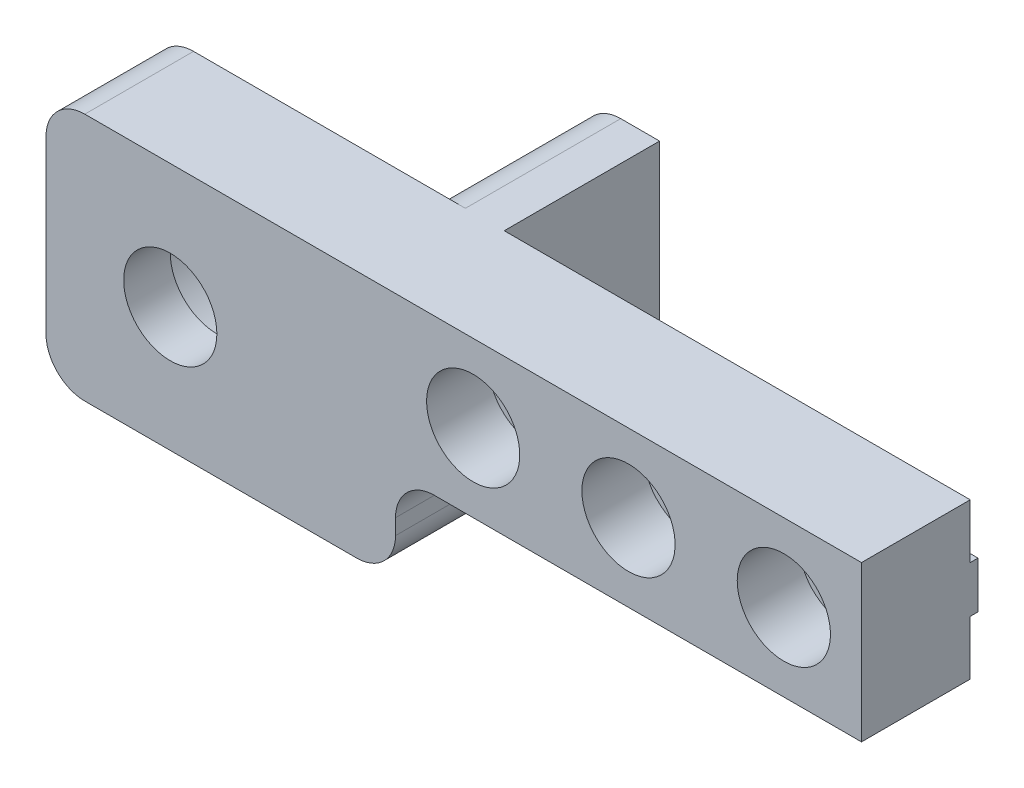
ISO-10303-21;
HEADER;
FILE_DESCRIPTION(('STEP AP214'),'2;1');
FILE_NAME('part.step','',(''),(''),'','','');
FILE_SCHEMA(('AUTOMOTIVE_DESIGN { 1 0 10303 214 1 1 1 1 }'));
ENDSEC;
DATA;
#1=APPLICATION_CONTEXT('core data for automotive mechanical design processes');
#2=APPLICATION_PROTOCOL_DEFINITION('international standard','automotive_design',2000,#1);
#3=PRODUCT_CONTEXT('',#1,'mechanical');
#4=PRODUCT('Part','Part','',(#3));
#5=PRODUCT_RELATED_PRODUCT_CATEGORY('part','',(#4));
#6=PRODUCT_DEFINITION_FORMATION('','',#4);
#7=PRODUCT_DEFINITION_CONTEXT('part definition',#1,'design');
#8=PRODUCT_DEFINITION('design','',#6,#7);
#9=PRODUCT_DEFINITION_SHAPE('','',#8);
#10=(LENGTH_UNIT() NAMED_UNIT(*) SI_UNIT(.MILLI.,.METRE.));
#11=(NAMED_UNIT(*) PLANE_ANGLE_UNIT() SI_UNIT($,.RADIAN.));
#12=(NAMED_UNIT(*) SI_UNIT($,.STERADIAN.) SOLID_ANGLE_UNIT());
#13=UNCERTAINTY_MEASURE_WITH_UNIT(LENGTH_MEASURE(1.E-05),#10,'distance_accuracy_value','');
#14=(GEOMETRIC_REPRESENTATION_CONTEXT(3) GLOBAL_UNCERTAINTY_ASSIGNED_CONTEXT((#13)) GLOBAL_UNIT_ASSIGNED_CONTEXT((#10,
#11,#12)) REPRESENTATION_CONTEXT('',''));
#15=CARTESIAN_POINT('',(0.,0.,0.));
#16=DIRECTION('',(0.,0.,1.));
#17=DIRECTION('',(1.,0.,0.));
#18=AXIS2_PLACEMENT_3D('',#15,#16,#17);
#19=CARTESIAN_POINT('',(-30.,-10.,-40.));
#20=DIRECTION('',(0.,0.,1.));
#21=DIRECTION('',(-1.,0.,0.));
#22=AXIS2_PLACEMENT_3D('',#19,#20,#21);
#23=CYLINDRICAL_SURFACE('',#22,2.75);
#24=CARTESIAN_POINT('',(-30.,-10.,-15.));
#25=DIRECTION('',(0.,0.,-1.));
#26=DIRECTION('',(-1.,0.,0.));
#27=AXIS2_PLACEMENT_3D('',#24,#25,#26);
#28=CIRCLE('',#27,2.75);
#29=CARTESIAN_POINT('',(-32.75,-10.,-15.));
#30=VERTEX_POINT('',#29);
#31=EDGE_CURVE('E327',#30,#30,#28,.T.);
#32=ORIENTED_EDGE('',*,*,#31,.T.);
#33=EDGE_LOOP('',(#32));
#34=FACE_BOUND('',#33,.T.);
#35=CARTESIAN_POINT('',(-30.,-10.,-8.));
#36=DIRECTION('',(0.,0.,-1.));
#37=DIRECTION('',(-1.,0.,0.));
#38=AXIS2_PLACEMENT_3D('',#35,#36,#37);
#39=CIRCLE('',#38,2.75);
#40=CARTESIAN_POINT('',(-32.75,-10.,-8.));
#41=VERTEX_POINT('',#40);
#42=EDGE_CURVE('E45',#41,#41,#39,.F.);
#43=ORIENTED_EDGE('',*,*,#42,.T.);
#44=EDGE_LOOP('',(#43));
#45=FACE_BOUND('',#44,.T.);
#46=ADVANCED_FACE('F41',(#34,#45),#23,.F.);
#47=CARTESIAN_POINT('',(-10.,-10.,-40.));
#48=DIRECTION('',(0.,0.,1.));
#49=DIRECTION('',(-1.,0.,0.));
#50=AXIS2_PLACEMENT_3D('',#47,#48,#49);
#51=CYLINDRICAL_SURFACE('',#50,2.75);
#52=CARTESIAN_POINT('',(-10.,-10.,-15.));
#53=DIRECTION('',(0.,0.,-1.));
#54=DIRECTION('',(-1.,0.,0.));
#55=AXIS2_PLACEMENT_3D('',#52,#53,#54);
#56=CIRCLE('',#55,2.75);
#57=CARTESIAN_POINT('',(-12.75,-10.,-15.));
#58=VERTEX_POINT('',#57);
#59=EDGE_CURVE('E330',#58,#58,#56,.T.);
#60=ORIENTED_EDGE('',*,*,#59,.T.);
#61=EDGE_LOOP('',(#60));
#62=FACE_BOUND('',#61,.T.);
#63=CARTESIAN_POINT('',(-10.,-10.,-8.));
#64=DIRECTION('',(0.,0.,-1.));
#65=DIRECTION('',(-1.,0.,0.));
#66=AXIS2_PLACEMENT_3D('',#63,#64,#65);
#67=CIRCLE('',#66,2.75);
#68=CARTESIAN_POINT('',(-12.75,-10.,-8.));
#69=VERTEX_POINT('',#68);
#70=EDGE_CURVE('E339',#69,#69,#67,.F.);
#71=ORIENTED_EDGE('',*,*,#70,.T.);
#72=EDGE_LOOP('',(#71));
#73=FACE_BOUND('',#72,.T.);
#74=ADVANCED_FACE('F366',(#62,#73),#51,.F.);
#75=CARTESIAN_POINT('',(-50.,-10.,-40.));
#76=DIRECTION('',(0.,0.,1.));
#77=DIRECTION('',(-1.,0.,0.));
#78=AXIS2_PLACEMENT_3D('',#75,#76,#77);
#79=CYLINDRICAL_SURFACE('',#78,2.75);
#80=CARTESIAN_POINT('',(-50.,-10.,-15.));
#81=DIRECTION('',(0.,0.,-1.));
#82=DIRECTION('',(-1.,0.,0.));
#83=AXIS2_PLACEMENT_3D('',#80,#81,#82);
#84=CIRCLE('',#83,2.75);
#85=CARTESIAN_POINT('',(-52.75,-10.,-15.));
#86=VERTEX_POINT('',#85);
#87=EDGE_CURVE('E333',#86,#86,#84,.T.);
#88=ORIENTED_EDGE('',*,*,#87,.T.);
#89=EDGE_LOOP('',(#88));
#90=FACE_BOUND('',#89,.T.);
#91=CARTESIAN_POINT('',(-50.,-10.,-8.));
#92=DIRECTION('',(0.,0.,-1.));
#93=DIRECTION('',(-1.,0.,0.));
#94=AXIS2_PLACEMENT_3D('',#91,#92,#93);
#95=CIRCLE('',#94,2.75);
#96=CARTESIAN_POINT('',(-52.75,-10.,-8.));
#97=VERTEX_POINT('',#96);
#98=EDGE_CURVE('E337',#97,#97,#95,.F.);
#99=ORIENTED_EDGE('',*,*,#98,.T.);
#100=EDGE_LOOP('',(#99));
#101=FACE_BOUND('',#100,.T.);
#102=ADVANCED_FACE('F372',(#90,#101),#79,.F.);
#103=CARTESIAN_POINT('',(0.,0.,-14.));
#104=DIRECTION('',(0.,0.,-1.));
#105=DIRECTION('',(1.,0.,0.));
#106=AXIS2_PLACEMENT_3D('',#103,#104,#105);
#107=PLANE('',#106);
#108=DIRECTION('',(1.,0.,0.));
#109=VECTOR('',#108,1.);
#110=CARTESIAN_POINT('',(-60.,-7.,-14.));
#111=LINE('',#110,#109);
#112=CARTESIAN_POINT('',(-60.,-7.,-14.));
#113=VERTEX_POINT('',#112);
#114=CARTESIAN_POINT('',(0.,-7.,-14.));
#115=VERTEX_POINT('',#114);
#116=EDGE_CURVE('E184',#113,#115,#111,.T.);
#117=ORIENTED_EDGE('',*,*,#116,.F.);
#118=DIRECTION('',(0.,1.,0.));
#119=VECTOR('',#118,1.);
#120=CARTESIAN_POINT('',(-60.,-32.,-14.));
#121=LINE('',#120,#119);
#122=CARTESIAN_POINT('',(-60.,0.,-14.));
#123=VERTEX_POINT('',#122);
#124=EDGE_CURVE('E211',#113,#123,#121,.T.);
#125=ORIENTED_EDGE('',*,*,#124,.T.);
#126=DIRECTION('',(-1.,0.,0.));
#127=VECTOR('',#126,1.);
#128=CARTESIAN_POINT('',(0.,0.,-14.));
#129=LINE('',#128,#127);
#130=CARTESIAN_POINT('',(0.,0.,-14.));
#131=VERTEX_POINT('',#130);
#132=EDGE_CURVE('E238',#131,#123,#129,.T.);
#133=ORIENTED_EDGE('',*,*,#132,.F.);
#134=DIRECTION('',(0.,1.,0.));
#135=VECTOR('',#134,1.);
#136=CARTESIAN_POINT('',(0.,-20.,-14.));
#137=LINE('',#136,#135);
#138=EDGE_CURVE('E237',#115,#131,#137,.T.);
#139=ORIENTED_EDGE('',*,*,#138,.F.);
#140=EDGE_LOOP('',(#117,#125,#133,#139));
#141=FACE_BOUND('',#140,.T.);
#142=ADVANCED_FACE('F421',(#141),#107,.T.);
#143=DIRECTION('',(0.,-1.,0.));
#144=VECTOR('',#143,1.);
#145=CARTESIAN_POINT('',(-105.,0.,-14.));
#146=LINE('',#145,#144);
#147=CARTESIAN_POINT('',(-105.,-5.00000000000001,-14.));
#148=VERTEX_POINT('',#147);
#149=CARTESIAN_POINT('',(-105.,-27.,-14.));
#150=VERTEX_POINT('',#149);
#151=EDGE_CURVE('E241',#148,#150,#146,.T.);
#152=ORIENTED_EDGE('',*,*,#151,.F.);
#153=CARTESIAN_POINT('',(-100.,-5.00000000000001,-14.));
#154=DIRECTION('',(0.,0.,1.));
#155=DIRECTION('',(1.,0.,0.));
#156=AXIS2_PLACEMENT_3D('',#153,#154,#155);
#157=CIRCLE('',#156,5.);
#158=CARTESIAN_POINT('',(-100.,0.,-14.));
#159=VERTEX_POINT('',#158);
#160=EDGE_CURVE('E303',#159,#148,#157,.T.);
#161=ORIENTED_EDGE('',*,*,#160,.F.);
#162=CARTESIAN_POINT('',(-65.,0.,-14.));
#163=VERTEX_POINT('',#162);
#164=EDGE_CURVE('E236',#163,#159,#129,.T.);
#165=ORIENTED_EDGE('',*,*,#164,.F.);
#166=CARTESIAN_POINT('',(-65.,-5.00000000000001,-14.));
#167=DIRECTION('',(0.,0.,1.));
#168=DIRECTION('',(1.,0.,0.));
#169=AXIS2_PLACEMENT_3D('',#166,#167,#168);
#170=CIRCLE('',#169,5.);
#171=CARTESIAN_POINT('',(-70.,-5.00000000000001,-14.));
#172=VERTEX_POINT('',#171);
#173=EDGE_CURVE('E11',#172,#163,#170,.F.);
#174=ORIENTED_EDGE('',*,*,#173,.F.);
#175=DIRECTION('',(0.,-1.,0.));
#176=VECTOR('',#175,1.);
#177=CARTESIAN_POINT('',(-70.,0.,-14.));
#178=LINE('',#177,#176);
#179=CARTESIAN_POINT('',(-70.,-27.,-14.));
#180=VERTEX_POINT('',#179);
#181=EDGE_CURVE('E200',#172,#180,#178,.T.);
#182=ORIENTED_EDGE('',*,*,#181,.T.);
#183=CARTESIAN_POINT('',(-65.,-27.,-14.));
#184=DIRECTION('',(0.,0.,1.));
#185=DIRECTION('',(1.,0.,0.));
#186=AXIS2_PLACEMENT_3D('',#183,#184,#185);
#187=CIRCLE('',#186,5.);
#188=CARTESIAN_POINT('',(-65.,-32.,-14.));
#189=VERTEX_POINT('',#188);
#190=EDGE_CURVE('E50',#189,#180,#187,.F.);
#191=ORIENTED_EDGE('',*,*,#190,.F.);
#192=DIRECTION('',(1.,0.,0.));
#193=VECTOR('',#192,1.);
#194=CARTESIAN_POINT('',(-105.,-32.,-14.));
#195=LINE('',#194,#193);
#196=CARTESIAN_POINT('',(-100.,-32.,-14.));
#197=VERTEX_POINT('',#196);
#198=EDGE_CURVE('E244',#197,#189,#195,.T.);
#199=ORIENTED_EDGE('',*,*,#198,.F.);
#200=CARTESIAN_POINT('',(-100.,-27.,-14.));
#201=DIRECTION('',(0.,0.,1.));
#202=DIRECTION('',(1.,0.,0.));
#203=AXIS2_PLACEMENT_3D('',#200,#201,#202);
#204=CIRCLE('',#203,5.);
#205=EDGE_CURVE('E306',#150,#197,#204,.T.);
#206=ORIENTED_EDGE('',*,*,#205,.F.);
#207=EDGE_LOOP('',(#152,#161,#165,#174,#182,#191,#199,#206));
#208=FACE_BOUND('',#207,.T.);
#209=CARTESIAN_POINT('',(-89.,-16.,-14.));
#210=DIRECTION('',(0.,0.,1.));
#211=DIRECTION('',(1.,0.,0.));
#212=AXIS2_PLACEMENT_3D('',#209,#210,#211);
#213=CIRCLE('',#212,11.25);
#214=CARTESIAN_POINT('',(-77.75,-16.,-14.));
#215=VERTEX_POINT('',#214);
#216=EDGE_CURVE('E226',#215,#215,#213,.T.);
#217=ORIENTED_EDGE('',*,*,#216,.T.);
#218=EDGE_LOOP('',(#217));
#219=FACE_BOUND('',#218,.T.);
#220=ADVANCED_FACE('F422',(#208,#219),#107,.T.);
#221=CARTESIAN_POINT('',(0.,-20.,-14.));
#222=DIRECTION('',(-1.,0.,0.));
#223=DIRECTION('',(0.,0.,-1.));
#224=AXIS2_PLACEMENT_3D('',#221,#222,#223);
#225=PLANE('',#224);
#226=DIRECTION('',(0.,1.,0.));
#227=VECTOR('',#226,1.);
#228=CARTESIAN_POINT('',(0.,-20.,0.));
#229=LINE('',#228,#227);
#230=CARTESIAN_POINT('',(0.,-20.,0.));
#231=VERTEX_POINT('',#230);
#232=CARTESIAN_POINT('',(0.,0.,0.));
#233=VERTEX_POINT('',#232);
#234=EDGE_CURVE('E232',#231,#233,#229,.T.);
#235=ORIENTED_EDGE('',*,*,#234,.F.);
#236=DIRECTION('',(0.,0.,1.));
#237=VECTOR('',#236,1.);
#238=CARTESIAN_POINT('',(0.,-20.,-14.));
#239=LINE('',#238,#237);
#240=CARTESIAN_POINT('',(0.,-20.,-14.));
#241=VERTEX_POINT('',#240);
#242=EDGE_CURVE('E249',#241,#231,#239,.T.);
#243=ORIENTED_EDGE('',*,*,#242,.F.);
#244=CARTESIAN_POINT('',(0.,-13.,-14.));
#245=VERTEX_POINT('',#244);
#246=EDGE_CURVE('E190',#241,#245,#137,.T.);
#247=ORIENTED_EDGE('',*,*,#246,.T.);
#248=DIRECTION('',(0.,0.,1.));
#249=VECTOR('',#248,1.);
#250=CARTESIAN_POINT('',(0.,-13.,-15.));
#251=LINE('',#250,#249);
#252=CARTESIAN_POINT('',(0.,-13.,-15.));
#253=VERTEX_POINT('',#252);
#254=EDGE_CURVE('E173',#253,#245,#251,.T.);
#255=ORIENTED_EDGE('',*,*,#254,.F.);
#256=DIRECTION('',(0.,-1.,0.));
#257=VECTOR('',#256,1.);
#258=CARTESIAN_POINT('',(0.,-7.,-15.));
#259=LINE('',#258,#257);
#260=CARTESIAN_POINT('',(0.,-7.,-15.));
#261=VERTEX_POINT('',#260);
#262=EDGE_CURVE('E179',#261,#253,#259,.T.);
#263=ORIENTED_EDGE('',*,*,#262,.F.);
#264=DIRECTION('',(0.,0.,1.));
#265=VECTOR('',#264,1.);
#266=CARTESIAN_POINT('',(0.,-7.,-15.));
#267=LINE('',#266,#265);
#268=EDGE_CURVE('E326',#261,#115,#267,.T.);
#269=ORIENTED_EDGE('',*,*,#268,.T.);
#270=ORIENTED_EDGE('',*,*,#138,.T.);
#271=DIRECTION('',(0.,0.,1.));
#272=VECTOR('',#271,1.);
#273=CARTESIAN_POINT('',(0.,0.,-14.));
#274=LINE('',#273,#272);
#275=EDGE_CURVE('E268',#131,#233,#274,.T.);
#276=ORIENTED_EDGE('',*,*,#275,.T.);
#277=EDGE_LOOP('',(#235,#243,#247,#255,#263,#269,#270,#276));
#278=FACE_BOUND('',#277,.T.);
#279=ADVANCED_FACE('F187',(#278),#225,.F.);
#280=CARTESIAN_POINT('',(0.,0.,-14.));
#281=DIRECTION('',(0.,-1.,0.));
#282=DIRECTION('',(1.,0.,0.));
#283=AXIS2_PLACEMENT_3D('',#280,#281,#282);
#284=PLANE('',#283);
#285=DIRECTION('',(-1.,0.,0.));
#286=VECTOR('',#285,1.);
#287=CARTESIAN_POINT('',(0.,0.,0.));
#288=LINE('',#287,#286);
#289=CARTESIAN_POINT('',(-100.,0.,0.));
#290=VERTEX_POINT('',#289);
#291=EDGE_CURVE('E252',#233,#290,#288,.T.);
#292=ORIENTED_EDGE('',*,*,#291,.F.);
#293=ORIENTED_EDGE('',*,*,#275,.F.);
#294=ORIENTED_EDGE('',*,*,#132,.T.);
#295=DIRECTION('',(0.,0.,1.));
#296=VECTOR('',#295,1.);
#297=CARTESIAN_POINT('',(-60.,0.,-34.));
#298=LINE('',#297,#296);
#299=CARTESIAN_POINT('',(-60.,0.,-34.));
#300=VERTEX_POINT('',#299);
#301=EDGE_CURVE('E206',#300,#123,#298,.T.);
#302=ORIENTED_EDGE('',*,*,#301,.F.);
#303=DIRECTION('',(-1.,0.,0.));
#304=VECTOR('',#303,1.);
#305=CARTESIAN_POINT('',(-60.,0.,-34.));
#306=LINE('',#305,#304);
#307=CARTESIAN_POINT('',(-65.,0.,-34.));
#308=VERTEX_POINT('',#307);
#309=EDGE_CURVE('E199',#300,#308,#306,.T.);
#310=ORIENTED_EDGE('',*,*,#309,.T.);
#311=DIRECTION('',(0.,0.,1.));
#312=VECTOR('',#311,1.);
#313=CARTESIAN_POINT('',(-65.,0.,-14.));
#314=LINE('',#313,#312);
#315=EDGE_CURVE('E309',#163,#308,#314,.F.);
#316=ORIENTED_EDGE('',*,*,#315,.F.);
#317=ORIENTED_EDGE('',*,*,#164,.T.);
#318=DIRECTION('',(0.,0.,1.));
#319=VECTOR('',#318,1.);
#320=CARTESIAN_POINT('',(-100.,0.,-14.));
#321=LINE('',#320,#319);
#322=EDGE_CURVE('E312',#290,#159,#321,.F.);
#323=ORIENTED_EDGE('',*,*,#322,.F.);
#324=EDGE_LOOP('',(#292,#293,#294,#302,#310,#316,#317,#323));
#325=FACE_BOUND('',#324,.T.);
#326=ADVANCED_FACE('F440',(#325),#284,.F.);
#327=CARTESIAN_POINT('',(-105.,0.,-14.));
#328=DIRECTION('',(1.,0.,0.));
#329=DIRECTION('',(0.,1.,0.));
#330=AXIS2_PLACEMENT_3D('',#327,#328,#329);
#331=PLANE('',#330);
#332=DIRECTION('',(0.,-1.,0.));
#333=VECTOR('',#332,1.);
#334=CARTESIAN_POINT('',(-105.,0.,0.));
#335=LINE('',#334,#333);
#336=CARTESIAN_POINT('',(-105.,-5.00000000000001,0.));
#337=VERTEX_POINT('',#336);
#338=CARTESIAN_POINT('',(-105.,-27.,0.));
#339=VERTEX_POINT('',#338);
#340=EDGE_CURVE('E255',#337,#339,#335,.T.);
#341=ORIENTED_EDGE('',*,*,#340,.F.);
#342=DIRECTION('',(0.,0.,1.));
#343=VECTOR('',#342,1.);
#344=CARTESIAN_POINT('',(-105.,-5.00000000000001,-14.));
#345=LINE('',#344,#343);
#346=EDGE_CURVE('E298',#148,#337,#345,.T.);
#347=ORIENTED_EDGE('',*,*,#346,.F.);
#348=ORIENTED_EDGE('',*,*,#151,.T.);
#349=DIRECTION('',(0.,0.,1.));
#350=VECTOR('',#349,1.);
#351=CARTESIAN_POINT('',(-105.,-27.,-14.));
#352=LINE('',#351,#350);
#353=EDGE_CURVE('E301',#339,#150,#352,.F.);
#354=ORIENTED_EDGE('',*,*,#353,.F.);
#355=EDGE_LOOP('',(#341,#347,#348,#354));
#356=FACE_BOUND('',#355,.T.);
#357=ADVANCED_FACE('F436',(#356),#331,.F.);
#358=CARTESIAN_POINT('',(-105.,-32.,-14.));
#359=DIRECTION('',(0.,1.,0.));
#360=DIRECTION('',(-1.,0.,0.));
#361=AXIS2_PLACEMENT_3D('',#358,#359,#360);
#362=PLANE('',#361);
#363=ORIENTED_EDGE('',*,*,#198,.T.);
#364=DIRECTION('',(0.,0.,1.));
#365=VECTOR('',#364,1.);
#366=CARTESIAN_POINT('',(-65.,-32.,-14.));
#367=LINE('',#366,#365);
#368=CARTESIAN_POINT('',(-65.,-32.,0.));
#369=VERTEX_POINT('',#368);
#370=EDGE_CURVE('E282',#369,#189,#367,.F.);
#371=ORIENTED_EDGE('',*,*,#370,.F.);
#372=DIRECTION('',(1.,0.,0.));
#373=VECTOR('',#372,1.);
#374=CARTESIAN_POINT('',(-105.,-32.,0.));
#375=LINE('',#374,#373);
#376=CARTESIAN_POINT('',(-100.,-32.,0.));
#377=VERTEX_POINT('',#376);
#378=EDGE_CURVE('E258',#377,#369,#375,.T.);
#379=ORIENTED_EDGE('',*,*,#378,.F.);
#380=DIRECTION('',(0.,0.,1.));
#381=VECTOR('',#380,1.);
#382=CARTESIAN_POINT('',(-100.,-32.,-14.));
#383=LINE('',#382,#381);
#384=EDGE_CURVE('E285',#197,#377,#383,.T.);
#385=ORIENTED_EDGE('',*,*,#384,.F.);
#386=EDGE_LOOP('',(#363,#371,#379,#385));
#387=FACE_BOUND('',#386,.T.);
#388=ADVANCED_FACE('F432',(#387),#362,.F.);
#389=CARTESIAN_POINT('',(-60.,-32.,-14.));
#390=DIRECTION('',(-1.,0.,0.));
#391=DIRECTION('',(0.,0.,-1.));
#392=AXIS2_PLACEMENT_3D('',#389,#390,#391);
#393=PLANE('',#392);
#394=DIRECTION('',(0.,1.,0.));
#395=VECTOR('',#394,1.);
#396=CARTESIAN_POINT('',(-60.,-13.,-15.));
#397=LINE('',#396,#395);
#398=CARTESIAN_POINT('',(-60.,-13.,-15.));
#399=VERTEX_POINT('',#398);
#400=CARTESIAN_POINT('',(-60.,-7.,-15.));
#401=VERTEX_POINT('',#400);
#402=EDGE_CURVE('E178',#399,#401,#397,.T.);
#403=ORIENTED_EDGE('',*,*,#402,.F.);
#404=DIRECTION('',(0.,0.,1.));
#405=VECTOR('',#404,1.);
#406=CARTESIAN_POINT('',(-60.,-13.,-15.));
#407=LINE('',#406,#405);
#408=CARTESIAN_POINT('',(-60.,-13.,-14.));
#409=VERTEX_POINT('',#408);
#410=EDGE_CURVE('E176',#399,#409,#407,.T.);
#411=ORIENTED_EDGE('',*,*,#410,.T.);
#412=CARTESIAN_POINT('',(-60.,-25.,-14.));
#413=VERTEX_POINT('',#412);
#414=EDGE_CURVE('E207',#413,#409,#121,.T.);
#415=ORIENTED_EDGE('',*,*,#414,.F.);
#416=DIRECTION('',(0.,0.,1.));
#417=VECTOR('',#416,1.);
#418=CARTESIAN_POINT('',(-60.,-25.,-14.));
#419=LINE('',#418,#417);
#420=CARTESIAN_POINT('',(-60.,-25.,0.));
#421=VERTEX_POINT('',#420);
#422=EDGE_CURVE('E210',#421,#413,#419,.F.);
#423=ORIENTED_EDGE('',*,*,#422,.F.);
#424=DIRECTION('',(0.,1.,0.));
#425=VECTOR('',#424,1.);
#426=CARTESIAN_POINT('',(-60.,-32.,0.));
#427=LINE('',#426,#425);
#428=CARTESIAN_POINT('',(-60.,-27.,0.));
#429=VERTEX_POINT('',#428);
#430=EDGE_CURVE('E261',#429,#421,#427,.T.);
#431=ORIENTED_EDGE('',*,*,#430,.F.);
#432=DIRECTION('',(0.,0.,1.));
#433=VECTOR('',#432,1.);
#434=CARTESIAN_POINT('',(-60.,-27.,-14.));
#435=LINE('',#434,#433);
#436=CARTESIAN_POINT('',(-60.,-27.,-34.));
#437=VERTEX_POINT('',#436);
#438=EDGE_CURVE('E273',#437,#429,#435,.T.);
#439=ORIENTED_EDGE('',*,*,#438,.F.);
#440=DIRECTION('',(0.,1.,0.));
#441=VECTOR('',#440,1.);
#442=CARTESIAN_POINT('',(-60.,-32.,-34.));
#443=LINE('',#442,#441);
#444=EDGE_CURVE('E197',#437,#300,#443,.T.);
#445=ORIENTED_EDGE('',*,*,#444,.T.);
#446=ORIENTED_EDGE('',*,*,#301,.T.);
#447=ORIENTED_EDGE('',*,*,#124,.F.);
#448=DIRECTION('',(0.,0.,1.));
#449=VECTOR('',#448,1.);
#450=CARTESIAN_POINT('',(-60.,-7.,-15.));
#451=LINE('',#450,#449);
#452=EDGE_CURVE('E192',#401,#113,#451,.T.);
#453=ORIENTED_EDGE('',*,*,#452,.F.);
#454=EDGE_LOOP('',(#403,#411,#415,#423,#431,#439,#445,#446,#447,#453));
#455=FACE_BOUND('',#454,.T.);
#456=ADVANCED_FACE('F428',(#455),#393,.F.);
#457=CARTESIAN_POINT('',(-60.,-20.,-14.));
#458=DIRECTION('',(0.,1.,0.));
#459=DIRECTION('',(0.,0.,-1.));
#460=AXIS2_PLACEMENT_3D('',#457,#458,#459);
#461=PLANE('',#460);
#462=DIRECTION('',(1.,0.,0.));
#463=VECTOR('',#462,1.);
#464=CARTESIAN_POINT('',(-60.,-20.,-14.));
#465=LINE('',#464,#463);
#466=CARTESIAN_POINT('',(-55.,-20.,-14.));
#467=VERTEX_POINT('',#466);
#468=EDGE_CURVE('E247',#467,#241,#465,.T.);
#469=ORIENTED_EDGE('',*,*,#468,.T.);
#470=ORIENTED_EDGE('',*,*,#242,.T.);
#471=DIRECTION('',(1.,0.,0.));
#472=VECTOR('',#471,1.);
#473=CARTESIAN_POINT('',(-60.,-20.,0.));
#474=LINE('',#473,#472);
#475=CARTESIAN_POINT('',(-55.,-20.,0.));
#476=VERTEX_POINT('',#475);
#477=EDGE_CURVE('E264',#476,#231,#474,.T.);
#478=ORIENTED_EDGE('',*,*,#477,.F.);
#479=DIRECTION('',(0.,0.,1.));
#480=VECTOR('',#479,1.);
#481=CARTESIAN_POINT('',(-55.,-20.,0.));
#482=LINE('',#481,#480);
#483=EDGE_CURVE('E295',#467,#476,#482,.T.);
#484=ORIENTED_EDGE('',*,*,#483,.F.);
#485=EDGE_LOOP('',(#469,#470,#478,#484));
#486=FACE_BOUND('',#485,.T.);
#487=ADVANCED_FACE('F419',(#486),#461,.F.);
#488=DIRECTION('',(-1.,0.,0.));
#489=VECTOR('',#488,1.);
#490=CARTESIAN_POINT('',(0.,-13.,-14.));
#491=LINE('',#490,#489);
#492=EDGE_CURVE('E336',#245,#409,#491,.T.);
#493=ORIENTED_EDGE('',*,*,#492,.F.);
#494=ORIENTED_EDGE('',*,*,#246,.F.);
#495=ORIENTED_EDGE('',*,*,#468,.F.);
#496=CARTESIAN_POINT('',(-55.,-25.,-14.));
#497=DIRECTION('',(0.,0.,1.));
#498=DIRECTION('',(1.,0.,0.));
#499=AXIS2_PLACEMENT_3D('',#496,#497,#498);
#500=CIRCLE('',#499,5.);
#501=EDGE_CURVE('E321',#413,#467,#500,.F.);
#502=ORIENTED_EDGE('',*,*,#501,.F.);
#503=ORIENTED_EDGE('',*,*,#414,.T.);
#504=EDGE_LOOP('',(#493,#494,#495,#502,#503));
#505=FACE_BOUND('',#504,.T.);
#506=ADVANCED_FACE('F416',(#505),#107,.T.);
#507=CARTESIAN_POINT('',(0.,0.,0.));
#508=DIRECTION('',(0.,0.,-1.));
#509=DIRECTION('',(1.,0.,0.));
#510=AXIS2_PLACEMENT_3D('',#507,#508,#509);
#511=PLANE('',#510);
#512=CARTESIAN_POINT('',(-10.,-10.,0.));
#513=DIRECTION('',(0.,0.,-1.));
#514=DIRECTION('',(-1.,0.,0.));
#515=AXIS2_PLACEMENT_3D('',#512,#513,#514);
#516=CIRCLE('',#515,6.);
#517=CARTESIAN_POINT('',(-16.,-10.,0.));
#518=VERTEX_POINT('',#517);
#519=EDGE_CURVE('E523',#518,#518,#516,.T.);
#520=ORIENTED_EDGE('',*,*,#519,.T.);
#521=EDGE_LOOP('',(#520));
#522=FACE_BOUND('',#521,.T.);
#523=CARTESIAN_POINT('',(-30.,-10.,0.));
#524=DIRECTION('',(0.,0.,-1.));
#525=DIRECTION('',(-1.,0.,0.));
#526=AXIS2_PLACEMENT_3D('',#523,#524,#525);
#527=CIRCLE('',#526,6.);
#528=CARTESIAN_POINT('',(-36.,-10.,0.));
#529=VERTEX_POINT('',#528);
#530=EDGE_CURVE('E520',#529,#529,#527,.T.);
#531=ORIENTED_EDGE('',*,*,#530,.T.);
#532=EDGE_LOOP('',(#531));
#533=FACE_BOUND('',#532,.T.);
#534=CARTESIAN_POINT('',(-50.,-10.,0.));
#535=DIRECTION('',(0.,0.,-1.));
#536=DIRECTION('',(-1.,0.,0.));
#537=AXIS2_PLACEMENT_3D('',#534,#535,#536);
#538=CIRCLE('',#537,6.);
#539=CARTESIAN_POINT('',(-56.,-10.,0.));
#540=VERTEX_POINT('',#539);
#541=EDGE_CURVE('E514',#540,#540,#538,.T.);
#542=ORIENTED_EDGE('',*,*,#541,.T.);
#543=EDGE_LOOP('',(#542));
#544=FACE_BOUND('',#543,.T.);
#545=CARTESIAN_POINT('',(-89.,-16.,0.));
#546=DIRECTION('',(0.,0.,1.));
#547=DIRECTION('',(1.,0.,0.));
#548=AXIS2_PLACEMENT_3D('',#545,#546,#547);
#549=CIRCLE('',#548,6.);
#550=CARTESIAN_POINT('',(-83.,-16.,0.));
#551=VERTEX_POINT('',#550);
#552=EDGE_CURVE('E219',#551,#551,#549,.F.);
#553=ORIENTED_EDGE('',*,*,#552,.T.);
#554=EDGE_LOOP('',(#553));
#555=FACE_BOUND('',#554,.T.);
#556=ORIENTED_EDGE('',*,*,#430,.T.);
#557=CARTESIAN_POINT('',(-55.,-25.,0.));
#558=DIRECTION('',(0.,0.,1.));
#559=DIRECTION('',(1.,0.,0.));
#560=AXIS2_PLACEMENT_3D('',#557,#558,#559);
#561=CIRCLE('',#560,5.);
#562=EDGE_CURVE('E319',#476,#421,#561,.T.);
#563=ORIENTED_EDGE('',*,*,#562,.F.);
#564=ORIENTED_EDGE('',*,*,#477,.T.);
#565=ORIENTED_EDGE('',*,*,#234,.T.);
#566=ORIENTED_EDGE('',*,*,#291,.T.);
#567=CARTESIAN_POINT('',(-100.,-5.00000000000001,0.));
#568=DIRECTION('',(0.,0.,1.));
#569=DIRECTION('',(1.,0.,0.));
#570=AXIS2_PLACEMENT_3D('',#567,#568,#569);
#571=CIRCLE('',#570,5.);
#572=EDGE_CURVE('E276',#337,#290,#571,.F.);
#573=ORIENTED_EDGE('',*,*,#572,.F.);
#574=ORIENTED_EDGE('',*,*,#340,.T.);
#575=CARTESIAN_POINT('',(-100.,-27.,0.));
#576=DIRECTION('',(0.,0.,1.));
#577=DIRECTION('',(1.,0.,0.));
#578=AXIS2_PLACEMENT_3D('',#575,#576,#577);
#579=CIRCLE('',#578,5.);
#580=EDGE_CURVE('E278',#377,#339,#579,.F.);
#581=ORIENTED_EDGE('',*,*,#580,.F.);
#582=ORIENTED_EDGE('',*,*,#378,.T.);
#583=CARTESIAN_POINT('',(-65.,-27.,0.));
#584=DIRECTION('',(0.,0.,1.));
#585=DIRECTION('',(1.,0.,0.));
#586=AXIS2_PLACEMENT_3D('',#583,#584,#585);
#587=CIRCLE('',#586,5.);
#588=EDGE_CURVE('E280',#429,#369,#587,.F.);
#589=ORIENTED_EDGE('',*,*,#588,.F.);
#590=EDGE_LOOP('',(#556,#563,#564,#565,#566,#573,#574,#581,#582,#589));
#591=FACE_BOUND('',#590,.T.);
#592=ADVANCED_FACE('F414',(#522,#533,#544,#555,#591),#511,.F.);
#593=CARTESIAN_POINT('',(-89.,-16.,-7.));
#594=DIRECTION('',(0.,0.,-1.));
#595=DIRECTION('',(1.,0.,0.));
#596=AXIS2_PLACEMENT_3D('',#593,#594,#595);
#597=CYLINDRICAL_SURFACE('',#596,11.25);
#598=CARTESIAN_POINT('',(-89.,-16.,-7.));
#599=DIRECTION('',(0.,0.,1.));
#600=DIRECTION('',(1.,0.,0.));
#601=AXIS2_PLACEMENT_3D('',#598,#599,#600);
#602=CIRCLE('',#601,11.25);
#603=CARTESIAN_POINT('',(-77.75,-16.,-7.));
#604=VERTEX_POINT('',#603);
#605=EDGE_CURVE('E229',#604,#604,#602,.T.);
#606=ORIENTED_EDGE('',*,*,#605,.T.);
#607=EDGE_LOOP('',(#606));
#608=FACE_BOUND('',#607,.T.);
#609=ORIENTED_EDGE('',*,*,#216,.F.);
#610=EDGE_LOOP('',(#609));
#611=FACE_BOUND('',#610,.T.);
#612=ADVANCED_FACE('F410',(#608,#611),#597,.F.);
#613=CARTESIAN_POINT('',(-89.,-16.,-7.));
#614=DIRECTION('',(0.,0.,-1.));
#615=DIRECTION('',(1.,0.,0.));
#616=AXIS2_PLACEMENT_3D('',#613,#614,#615);
#617=PLANE('',#616);
#618=CARTESIAN_POINT('',(-89.,-16.,-7.));
#619=DIRECTION('',(0.,0.,1.));
#620=DIRECTION('',(1.,0.,0.));
#621=AXIS2_PLACEMENT_3D('',#618,#619,#620);
#622=CIRCLE('',#621,9.00000000000001);
#623=CARTESIAN_POINT('',(-80.,-16.,-7.));
#624=VERTEX_POINT('',#623);
#625=EDGE_CURVE('E222',#624,#624,#622,.T.);
#626=ORIENTED_EDGE('',*,*,#625,.T.);
#627=EDGE_LOOP('',(#626));
#628=FACE_BOUND('',#627,.T.);
#629=ORIENTED_EDGE('',*,*,#605,.F.);
#630=EDGE_LOOP('',(#629));
#631=FACE_BOUND('',#630,.T.);
#632=ADVANCED_FACE('F406',(#628,#631),#617,.T.);
#633=CARTESIAN_POINT('',(-89.,-16.,-6.));
#634=DIRECTION('',(0.,0.,-1.));
#635=DIRECTION('',(1.,0.,0.));
#636=AXIS2_PLACEMENT_3D('',#633,#634,#635);
#637=CYLINDRICAL_SURFACE('',#636,9.00000000000001);
#638=CARTESIAN_POINT('',(-89.,-16.,-6.));
#639=DIRECTION('',(0.,0.,1.));
#640=DIRECTION('',(1.,0.,0.));
#641=AXIS2_PLACEMENT_3D('',#638,#639,#640);
#642=CIRCLE('',#641,9.00000000000001);
#643=CARTESIAN_POINT('',(-80.,-16.,-6.));
#644=VERTEX_POINT('',#643);
#645=EDGE_CURVE('E223',#644,#644,#642,.T.);
#646=ORIENTED_EDGE('',*,*,#645,.T.);
#647=EDGE_LOOP('',(#646));
#648=FACE_BOUND('',#647,.T.);
#649=ORIENTED_EDGE('',*,*,#625,.F.);
#650=EDGE_LOOP('',(#649));
#651=FACE_BOUND('',#650,.T.);
#652=ADVANCED_FACE('F402',(#648,#651),#637,.F.);
#653=CARTESIAN_POINT('',(-89.,-16.,-6.));
#654=DIRECTION('',(0.,0.,-1.));
#655=DIRECTION('',(1.,0.,0.));
#656=AXIS2_PLACEMENT_3D('',#653,#654,#655);
#657=PLANE('',#656);
#658=CARTESIAN_POINT('',(-89.,-16.,-6.));
#659=DIRECTION('',(0.,0.,1.));
#660=DIRECTION('',(1.,0.,0.));
#661=AXIS2_PLACEMENT_3D('',#658,#659,#660);
#662=CIRCLE('',#661,6.);
#663=CARTESIAN_POINT('',(-83.,-16.,-6.));
#664=VERTEX_POINT('',#663);
#665=EDGE_CURVE('E216',#664,#664,#662,.T.);
#666=ORIENTED_EDGE('',*,*,#665,.T.);
#667=EDGE_LOOP('',(#666));
#668=FACE_BOUND('',#667,.T.);
#669=ORIENTED_EDGE('',*,*,#645,.F.);
#670=EDGE_LOOP('',(#669));
#671=FACE_BOUND('',#670,.T.);
#672=ADVANCED_FACE('F398',(#668,#671),#657,.T.);
#673=CARTESIAN_POINT('',(-89.,-16.,0.00100000000000013));
#674=DIRECTION('',(0.,0.,-1.));
#675=DIRECTION('',(1.,0.,0.));
#676=AXIS2_PLACEMENT_3D('',#673,#674,#675);
#677=CYLINDRICAL_SURFACE('',#676,6.);
#678=CARTESIAN_POINT('',(-83.,-16.,-6.));
#679=CARTESIAN_POINT('',(-83.,-16.,-5.9375));
#680=CARTESIAN_POINT('',(-83.,-16.,-5.875));
#681=CARTESIAN_POINT('',(-83.,-16.,-5.75));
#682=CARTESIAN_POINT('',(-83.,-16.,-5.6875));
#683=CARTESIAN_POINT('',(-83.,-16.,-5.5625));
#684=CARTESIAN_POINT('',(-83.,-16.,-5.5));
#685=CARTESIAN_POINT('',(-83.,-16.,-5.375));
#686=CARTESIAN_POINT('',(-83.,-16.,-5.3125));
#687=CARTESIAN_POINT('',(-83.,-16.,-5.1875));
#688=CARTESIAN_POINT('',(-83.,-16.,-5.125));
#689=CARTESIAN_POINT('',(-83.,-16.,-5.));
#690=CARTESIAN_POINT('',(-83.,-16.,-4.9375));
#691=CARTESIAN_POINT('',(-83.,-16.,-4.8125));
#692=CARTESIAN_POINT('',(-83.,-16.,-4.75));
#693=CARTESIAN_POINT('',(-83.,-16.,-4.625));
#694=CARTESIAN_POINT('',(-83.,-16.,-4.5625));
#695=CARTESIAN_POINT('',(-83.,-16.,-4.4375));
#696=CARTESIAN_POINT('',(-83.,-16.,-4.375));
#697=CARTESIAN_POINT('',(-83.,-16.,-4.25));
#698=CARTESIAN_POINT('',(-83.,-16.,-4.1875));
#699=CARTESIAN_POINT('',(-83.,-16.,-4.0625));
#700=CARTESIAN_POINT('',(-83.,-16.,-4.));
#701=CARTESIAN_POINT('',(-83.,-16.,-3.875));
#702=CARTESIAN_POINT('',(-83.,-16.,-3.8125));
#703=CARTESIAN_POINT('',(-83.,-16.,-3.6875));
#704=CARTESIAN_POINT('',(-83.,-16.,-3.625));
#705=CARTESIAN_POINT('',(-83.,-16.,-3.5));
#706=CARTESIAN_POINT('',(-83.,-16.,-3.4375));
#707=CARTESIAN_POINT('',(-83.,-16.,-3.3125));
#708=CARTESIAN_POINT('',(-83.,-16.,-3.25));
#709=CARTESIAN_POINT('',(-83.,-16.,-3.125));
#710=CARTESIAN_POINT('',(-83.,-16.,-3.0625));
#711=CARTESIAN_POINT('',(-83.,-16.,-2.9375));
#712=CARTESIAN_POINT('',(-83.,-16.,-2.875));
#713=CARTESIAN_POINT('',(-83.,-16.,-2.75));
#714=CARTESIAN_POINT('',(-83.,-16.,-2.6875));
#715=CARTESIAN_POINT('',(-83.,-16.,-2.5625));
#716=CARTESIAN_POINT('',(-83.,-16.,-2.5));
#717=CARTESIAN_POINT('',(-83.,-16.,-2.375));
#718=CARTESIAN_POINT('',(-83.,-16.,-2.3125));
#719=CARTESIAN_POINT('',(-83.,-16.,-2.1875));
#720=CARTESIAN_POINT('',(-83.,-16.,-2.125));
#721=CARTESIAN_POINT('',(-83.,-16.,-2.));
#722=CARTESIAN_POINT('',(-83.,-16.,-1.9375));
#723=CARTESIAN_POINT('',(-83.,-16.,-1.8125));
#724=CARTESIAN_POINT('',(-83.,-16.,-1.75));
#725=CARTESIAN_POINT('',(-83.,-16.,-1.625));
#726=CARTESIAN_POINT('',(-83.,-16.,-1.5625));
#727=CARTESIAN_POINT('',(-83.,-16.,-1.4375));
#728=CARTESIAN_POINT('',(-83.,-16.,-1.375));
#729=CARTESIAN_POINT('',(-83.,-16.,-1.25));
#730=CARTESIAN_POINT('',(-83.,-16.,-1.1875));
#731=CARTESIAN_POINT('',(-83.,-16.,-1.0625));
#732=CARTESIAN_POINT('',(-83.,-16.,-1.));
#733=CARTESIAN_POINT('',(-83.,-16.,-0.875));
#734=CARTESIAN_POINT('',(-83.,-16.,-0.8125));
#735=CARTESIAN_POINT('',(-83.,-16.,-0.6875));
#736=CARTESIAN_POINT('',(-83.,-16.,-0.625));
#737=CARTESIAN_POINT('',(-83.,-16.,-0.5));
#738=CARTESIAN_POINT('',(-83.,-16.,-0.4375));
#739=CARTESIAN_POINT('',(-83.,-16.,-0.3125));
#740=CARTESIAN_POINT('',(-83.,-16.,-0.25));
#741=CARTESIAN_POINT('',(-83.,-16.,-0.125));
#742=CARTESIAN_POINT('',(-83.,-16.,-0.0625000000000001));
#743=CARTESIAN_POINT('',(-83.,-16.,0.));
#744=B_SPLINE_CURVE_WITH_KNOTS('',3,(#678,#679,#680,#681,#682,#683,#684,#685,#686,#687,#688,
#689,#690,#691,#692,#693,#694,#695,#696,#697,#698,#699,#700,#701,#702,#703,#704,#705,#706,#707,
#708,#709,#710,#711,#712,#713,#714,#715,#716,#717,#718,#719,#720,#721,#722,#723,#724,#725,#726,
#727,#728,#729,#730,#731,#732,#733,#734,#735,#736,#737,#738,#739,#740,#741,#742,#743),
.UNSPECIFIED.,.F.,.F.,(4,2,2,2,2,2,2,2,2,2,2,2,2,2,2,2,2,2,2,2,2,2,2,2,2,2,2,2,2,2,2,2,4),(0.,
0.1875,0.375,0.5625,0.75,0.9375,1.125,1.3125,1.5,1.6875,1.875,2.0625,2.25,2.4375,2.625,2.8125,
3.,3.1875,3.375,3.5625,3.75,3.9375,4.125,4.3125,4.5,4.6875,4.875,5.0625,5.25,5.4375,5.625,
5.8125,6.),.UNSPECIFIED.);
#745=EDGE_CURVE('BSEAM394',#664,#551,#744,.T.);
#746=ORIENTED_EDGE('',*,*,#665,.F.);
#747=ORIENTED_EDGE('',*,*,#552,.F.);
#748=ORIENTED_EDGE('',*,*,#745,.T.);
#749=ORIENTED_EDGE('',*,*,#745,.F.);
#750=EDGE_LOOP('',(#746,#748,#747,#749));
#751=FACE_BOUND('',#750,.T.);
#752=ADVANCED_FACE('F394',(#751),#677,.F.);
#753=CARTESIAN_POINT('',(-70.,0.,-34.));
#754=DIRECTION('',(1.,0.,0.));
#755=DIRECTION('',(0.,0.,1.));
#756=AXIS2_PLACEMENT_3D('',#753,#754,#755);
#757=PLANE('',#756);
#758=ORIENTED_EDGE('',*,*,#181,.F.);
#759=DIRECTION('',(0.,0.,1.));
#760=VECTOR('',#759,1.);
#761=CARTESIAN_POINT('',(-70.,-5.00000000000001,-34.));
#762=LINE('',#761,#760);
#763=CARTESIAN_POINT('',(-70.,-5.00000000000001,-34.));
#764=VERTEX_POINT('',#763);
#765=EDGE_CURVE('E314',#764,#172,#762,.T.);
#766=ORIENTED_EDGE('',*,*,#765,.F.);
#767=DIRECTION('',(0.,-1.,0.));
#768=VECTOR('',#767,1.);
#769=CARTESIAN_POINT('',(-70.,0.,-34.));
#770=LINE('',#769,#768);
#771=CARTESIAN_POINT('',(-70.,-27.,-34.));
#772=VERTEX_POINT('',#771);
#773=EDGE_CURVE('E203',#764,#772,#770,.T.);
#774=ORIENTED_EDGE('',*,*,#773,.T.);
#775=DIRECTION('',(0.,0.,1.));
#776=VECTOR('',#775,1.);
#777=CARTESIAN_POINT('',(-70.,-27.,-34.));
#778=LINE('',#777,#776);
#779=EDGE_CURVE('E316',#180,#772,#778,.F.);
#780=ORIENTED_EDGE('',*,*,#779,.F.);
#781=EDGE_LOOP('',(#758,#766,#774,#780));
#782=FACE_BOUND('',#781,.T.);
#783=ADVANCED_FACE('F390',(#782),#757,.F.);
#784=CARTESIAN_POINT('',(0.,0.,-34.));
#785=DIRECTION('',(0.,0.,-1.));
#786=DIRECTION('',(1.,0.,0.));
#787=AXIS2_PLACEMENT_3D('',#784,#785,#786);
#788=PLANE('',#787);
#789=CARTESIAN_POINT('',(-65.,-27.,-34.));
#790=DIRECTION('',(0.,0.,1.));
#791=DIRECTION('',(1.,0.,0.));
#792=AXIS2_PLACEMENT_3D('',#789,#790,#791);
#793=CIRCLE('',#792,5.);
#794=CARTESIAN_POINT('',(-65.,-32.,-34.));
#795=VERTEX_POINT('',#794);
#796=EDGE_CURVE('E290',#772,#795,#793,.T.);
#797=ORIENTED_EDGE('',*,*,#796,.F.);
#798=ORIENTED_EDGE('',*,*,#773,.F.);
#799=CARTESIAN_POINT('',(-65.,-5.00000000000001,-34.));
#800=DIRECTION('',(0.,0.,1.));
#801=DIRECTION('',(1.,0.,0.));
#802=AXIS2_PLACEMENT_3D('',#799,#800,#801);
#803=CIRCLE('',#802,5.);
#804=EDGE_CURVE('E288',#308,#764,#803,.T.);
#805=ORIENTED_EDGE('',*,*,#804,.F.);
#806=ORIENTED_EDGE('',*,*,#309,.F.);
#807=ORIENTED_EDGE('',*,*,#444,.F.);
#808=CARTESIAN_POINT('',(-65.,-27.,-34.));
#809=DIRECTION('',(0.,0.,1.));
#810=DIRECTION('',(1.,0.,0.));
#811=AXIS2_PLACEMENT_3D('',#808,#809,#810);
#812=CIRCLE('',#811,5.);
#813=EDGE_CURVE('E293',#795,#437,#812,.T.);
#814=ORIENTED_EDGE('',*,*,#813,.F.);
#815=EDGE_LOOP('',(#797,#798,#805,#806,#807,#814));
#816=FACE_BOUND('',#815,.T.);
#817=ADVANCED_FACE('F386',(#816),#788,.T.);
#818=CARTESIAN_POINT('',(-65.,-27.,-14.));
#819=DIRECTION('',(0.,0.,1.));
#820=DIRECTION('',(-1.,0.,0.));
#821=AXIS2_PLACEMENT_3D('',#818,#819,#820);
#822=CYLINDRICAL_SURFACE('',#821,5.);
#823=ORIENTED_EDGE('',*,*,#779,.T.);
#824=ORIENTED_EDGE('',*,*,#796,.T.);
#825=DIRECTION('',(0.,0.,1.));
#826=VECTOR('',#825,1.);
#827=CARTESIAN_POINT('',(-65.,-32.,-14.));
#828=LINE('',#827,#826);
#829=EDGE_CURVE('E214',#795,#189,#828,.T.);
#830=ORIENTED_EDGE('',*,*,#829,.T.);
#831=ORIENTED_EDGE('',*,*,#190,.T.);
#832=EDGE_LOOP('',(#823,#824,#830,#831));
#833=FACE_BOUND('',#832,.T.);
#834=ADVANCED_FACE('F389',(#833),#822,.T.);
#835=CARTESIAN_POINT('',(-65.,-27.,-14.));
#836=DIRECTION('',(0.,0.,1.));
#837=DIRECTION('',(-1.,0.,0.));
#838=AXIS2_PLACEMENT_3D('',#835,#836,#837);
#839=CYLINDRICAL_SURFACE('',#838,5.);
#840=ORIENTED_EDGE('',*,*,#829,.F.);
#841=ORIENTED_EDGE('',*,*,#813,.T.);
#842=ORIENTED_EDGE('',*,*,#438,.T.);
#843=ORIENTED_EDGE('',*,*,#588,.T.);
#844=ORIENTED_EDGE('',*,*,#370,.T.);
#845=EDGE_LOOP('',(#840,#841,#842,#843,#844));
#846=FACE_BOUND('',#845,.T.);
#847=ADVANCED_FACE('F447',(#846),#839,.T.);
#848=CARTESIAN_POINT('',(-55.,-25.,-14.));
#849=DIRECTION('',(0.,0.,-1.));
#850=DIRECTION('',(1.,0.,0.));
#851=AXIS2_PLACEMENT_3D('',#848,#849,#850);
#852=CYLINDRICAL_SURFACE('',#851,5.);
#853=ORIENTED_EDGE('',*,*,#501,.T.);
#854=ORIENTED_EDGE('',*,*,#483,.T.);
#855=ORIENTED_EDGE('',*,*,#562,.T.);
#856=ORIENTED_EDGE('',*,*,#422,.T.);
#857=EDGE_LOOP('',(#853,#854,#855,#856));
#858=FACE_BOUND('',#857,.T.);
#859=ADVANCED_FACE('F450',(#858),#852,.F.);
#860=CARTESIAN_POINT('',(-100.,-27.,-14.));
#861=DIRECTION('',(0.,0.,1.));
#862=DIRECTION('',(-1.,0.,0.));
#863=AXIS2_PLACEMENT_3D('',#860,#861,#862);
#864=CYLINDRICAL_SURFACE('',#863,5.);
#865=ORIENTED_EDGE('',*,*,#205,.T.);
#866=ORIENTED_EDGE('',*,*,#384,.T.);
#867=ORIENTED_EDGE('',*,*,#580,.T.);
#868=ORIENTED_EDGE('',*,*,#353,.T.);
#869=EDGE_LOOP('',(#865,#866,#867,#868));
#870=FACE_BOUND('',#869,.T.);
#871=ADVANCED_FACE('F457',(#870),#864,.T.);
#872=CARTESIAN_POINT('',(-100.,-5.00000000000001,-14.));
#873=DIRECTION('',(0.,0.,1.));
#874=DIRECTION('',(-1.,0.,0.));
#875=AXIS2_PLACEMENT_3D('',#872,#873,#874);
#876=CYLINDRICAL_SURFACE('',#875,5.);
#877=ORIENTED_EDGE('',*,*,#160,.T.);
#878=ORIENTED_EDGE('',*,*,#346,.T.);
#879=ORIENTED_EDGE('',*,*,#572,.T.);
#880=ORIENTED_EDGE('',*,*,#322,.T.);
#881=EDGE_LOOP('',(#877,#878,#879,#880));
#882=FACE_BOUND('',#881,.T.);
#883=ADVANCED_FACE('F460',(#882),#876,.T.);
#884=CARTESIAN_POINT('',(-65.,-5.00000000000001,-34.));
#885=DIRECTION('',(0.,0.,1.));
#886=DIRECTION('',(-1.,0.,0.));
#887=AXIS2_PLACEMENT_3D('',#884,#885,#886);
#888=CYLINDRICAL_SURFACE('',#887,5.);
#889=ORIENTED_EDGE('',*,*,#804,.T.);
#890=ORIENTED_EDGE('',*,*,#765,.T.);
#891=ORIENTED_EDGE('',*,*,#173,.T.);
#892=ORIENTED_EDGE('',*,*,#315,.T.);
#893=EDGE_LOOP('',(#889,#890,#891,#892));
#894=FACE_BOUND('',#893,.T.);
#895=ADVANCED_FACE('F43',(#894),#888,.T.);
#896=CARTESIAN_POINT('',(-60.,-7.,-15.));
#897=DIRECTION('',(0.,1.,0.));
#898=DIRECTION('',(0.,0.,-1.));
#899=AXIS2_PLACEMENT_3D('',#896,#897,#898);
#900=PLANE('',#899);
#901=ORIENTED_EDGE('',*,*,#116,.T.);
#902=ORIENTED_EDGE('',*,*,#268,.F.);
#903=DIRECTION('',(1.,0.,0.));
#904=VECTOR('',#903,1.);
#905=CARTESIAN_POINT('',(-60.,-7.,-15.));
#906=LINE('',#905,#904);
#907=EDGE_CURVE('E66',#401,#261,#906,.T.);
#908=ORIENTED_EDGE('',*,*,#907,.F.);
#909=ORIENTED_EDGE('',*,*,#452,.T.);
#910=EDGE_LOOP('',(#901,#902,#908,#909));
#911=FACE_BOUND('',#910,.T.);
#912=ADVANCED_FACE('F381',(#911),#900,.T.);
#913=CARTESIAN_POINT('',(0.,-13.,-15.));
#914=DIRECTION('',(0.,-1.,0.));
#915=DIRECTION('',(1.,0.,0.));
#916=AXIS2_PLACEMENT_3D('',#913,#914,#915);
#917=PLANE('',#916);
#918=ORIENTED_EDGE('',*,*,#492,.T.);
#919=ORIENTED_EDGE('',*,*,#410,.F.);
#920=DIRECTION('',(-1.,0.,0.));
#921=VECTOR('',#920,1.);
#922=CARTESIAN_POINT('',(0.,-13.,-15.));
#923=LINE('',#922,#921);
#924=EDGE_CURVE('E58',#253,#399,#923,.T.);
#925=ORIENTED_EDGE('',*,*,#924,.F.);
#926=ORIENTED_EDGE('',*,*,#254,.T.);
#927=EDGE_LOOP('',(#918,#919,#925,#926));
#928=FACE_BOUND('',#927,.T.);
#929=ADVANCED_FACE('F171',(#928),#917,.T.);
#930=CARTESIAN_POINT('',(0.,0.,-15.));
#931=DIRECTION('',(0.,0.,1.));
#932=DIRECTION('',(-1.,0.,0.));
#933=AXIS2_PLACEMENT_3D('',#930,#931,#932);
#934=PLANE('',#933);
#935=ORIENTED_EDGE('',*,*,#87,.F.);
#936=EDGE_LOOP('',(#935));
#937=FACE_BOUND('',#936,.T.);
#938=ORIENTED_EDGE('',*,*,#59,.F.);
#939=EDGE_LOOP('',(#938));
#940=FACE_BOUND('',#939,.T.);
#941=ORIENTED_EDGE('',*,*,#31,.F.);
#942=EDGE_LOOP('',(#941));
#943=FACE_BOUND('',#942,.T.);
#944=ORIENTED_EDGE('',*,*,#262,.T.);
#945=ORIENTED_EDGE('',*,*,#924,.T.);
#946=ORIENTED_EDGE('',*,*,#402,.T.);
#947=ORIENTED_EDGE('',*,*,#907,.T.);
#948=EDGE_LOOP('',(#944,#945,#946,#947));
#949=FACE_BOUND('',#948,.T.);
#950=ADVANCED_FACE('F182',(#937,#940,#943,#949),#934,.F.);
#951=CARTESIAN_POINT('',(-50.,-10.,-8.));
#952=DIRECTION('',(0.,0.,1.));
#953=DIRECTION('',(-1.,0.,0.));
#954=AXIS2_PLACEMENT_3D('',#951,#952,#953);
#955=PLANE('',#954);
#956=CARTESIAN_POINT('',(-50.,-10.,-8.));
#957=DIRECTION('',(0.,0.,-1.));
#958=DIRECTION('',(-1.,0.,0.));
#959=AXIS2_PLACEMENT_3D('',#956,#957,#958);
#960=CIRCLE('',#959,6.);
#961=CARTESIAN_POINT('',(-56.,-10.,-8.));
#962=VERTEX_POINT('',#961);
#963=EDGE_CURVE('E511',#962,#962,#960,.T.);
#964=ORIENTED_EDGE('',*,*,#963,.F.);
#965=EDGE_LOOP('',(#964));
#966=FACE_BOUND('',#965,.T.);
#967=ORIENTED_EDGE('',*,*,#98,.F.);
#968=EDGE_LOOP('',(#967));
#969=FACE_BOUND('',#968,.T.);
#970=ADVANCED_FACE('F379',(#966,#969),#955,.T.);
#971=CARTESIAN_POINT('',(-50.,-10.,-8.));
#972=DIRECTION('',(0.,0.,1.));
#973=DIRECTION('',(-1.,0.,0.));
#974=AXIS2_PLACEMENT_3D('',#971,#972,#973);
#975=CYLINDRICAL_SURFACE('',#974,6.);
#976=ORIENTED_EDGE('',*,*,#963,.T.);
#977=EDGE_LOOP('',(#976));
#978=FACE_BOUND('',#977,.T.);
#979=ORIENTED_EDGE('',*,*,#541,.F.);
#980=EDGE_LOOP('',(#979));
#981=FACE_BOUND('',#980,.T.);
#982=ADVANCED_FACE('F532',(#978,#981),#975,.F.);
#983=CARTESIAN_POINT('',(-10.,-10.,-8.));
#984=DIRECTION('',(0.,0.,1.));
#985=DIRECTION('',(-1.,0.,0.));
#986=AXIS2_PLACEMENT_3D('',#983,#984,#985);
#987=PLANE('',#986);
#988=CARTESIAN_POINT('',(-10.,-10.,-8.));
#989=DIRECTION('',(0.,0.,-1.));
#990=DIRECTION('',(-1.,0.,0.));
#991=AXIS2_PLACEMENT_3D('',#988,#989,#990);
#992=CIRCLE('',#991,6.);
#993=CARTESIAN_POINT('',(-16.,-10.,-8.));
#994=VERTEX_POINT('',#993);
#995=EDGE_CURVE('E340',#994,#994,#992,.T.);
#996=ORIENTED_EDGE('',*,*,#995,.F.);
#997=EDGE_LOOP('',(#996));
#998=FACE_BOUND('',#997,.T.);
#999=ORIENTED_EDGE('',*,*,#70,.F.);
#1000=EDGE_LOOP('',(#999));
#1001=FACE_BOUND('',#1000,.T.);
#1002=ADVANCED_FACE('F360',(#998,#1001),#987,.T.);
#1003=CARTESIAN_POINT('',(-10.,-10.,-8.));
#1004=DIRECTION('',(0.,0.,1.));
#1005=DIRECTION('',(-1.,0.,0.));
#1006=AXIS2_PLACEMENT_3D('',#1003,#1004,#1005);
#1007=CYLINDRICAL_SURFACE('',#1006,6.);
#1008=ORIENTED_EDGE('',*,*,#995,.T.);
#1009=EDGE_LOOP('',(#1008));
#1010=FACE_BOUND('',#1009,.T.);
#1011=ORIENTED_EDGE('',*,*,#519,.F.);
#1012=EDGE_LOOP('',(#1011));
#1013=FACE_BOUND('',#1012,.T.);
#1014=ADVANCED_FACE('F351',(#1010,#1013),#1007,.F.);
#1015=CARTESIAN_POINT('',(-30.,-10.,-8.));
#1016=DIRECTION('',(0.,0.,1.));
#1017=DIRECTION('',(-1.,0.,0.));
#1018=AXIS2_PLACEMENT_3D('',#1015,#1016,#1017);
#1019=PLANE('',#1018);
#1020=CARTESIAN_POINT('',(-30.,-10.,-8.));
#1021=DIRECTION('',(0.,0.,-1.));
#1022=DIRECTION('',(-1.,0.,0.));
#1023=AXIS2_PLACEMENT_3D('',#1020,#1021,#1022);
#1024=CIRCLE('',#1023,6.);
#1025=CARTESIAN_POINT('',(-36.,-10.,-8.));
#1026=VERTEX_POINT('',#1025);
#1027=EDGE_CURVE('E517',#1026,#1026,#1024,.T.);
#1028=ORIENTED_EDGE('',*,*,#1027,.F.);
#1029=EDGE_LOOP('',(#1028));
#1030=FACE_BOUND('',#1029,.T.);
#1031=ORIENTED_EDGE('',*,*,#42,.F.);
#1032=EDGE_LOOP('',(#1031));
#1033=FACE_BOUND('',#1032,.T.);
#1034=ADVANCED_FACE('F348',(#1030,#1033),#1019,.T.);
#1035=CARTESIAN_POINT('',(-30.,-10.,-8.));
#1036=DIRECTION('',(0.,0.,1.));
#1037=DIRECTION('',(-1.,0.,0.));
#1038=AXIS2_PLACEMENT_3D('',#1035,#1036,#1037);
#1039=CYLINDRICAL_SURFACE('',#1038,6.);
#1040=ORIENTED_EDGE('',*,*,#1027,.T.);
#1041=EDGE_LOOP('',(#1040));
#1042=FACE_BOUND('',#1041,.T.);
#1043=ORIENTED_EDGE('',*,*,#530,.F.);
#1044=EDGE_LOOP('',(#1043));
#1045=FACE_BOUND('',#1044,.T.);
#1046=ADVANCED_FACE('F350',(#1042,#1045),#1039,.F.);
#1047=CLOSED_SHELL('',(#46,#74,#102,#142,#220,#279,#326,#357,#388,#456,#487,#506,#592,#612,#632,
#652,#672,#752,#783,#817,#834,#847,#859,#871,#883,#895,#912,#929,#950,#970,#982,#1002,#1014,
#1034,#1046));
#1048=MANIFOLD_SOLID_BREP('B2',#1047);
#1049=ADVANCED_BREP_SHAPE_REPRESENTATION('',(#18,#1048),#14);
#1050=SHAPE_DEFINITION_REPRESENTATION(#9,#1049);
ENDSEC;
END-ISO-10303-21;
